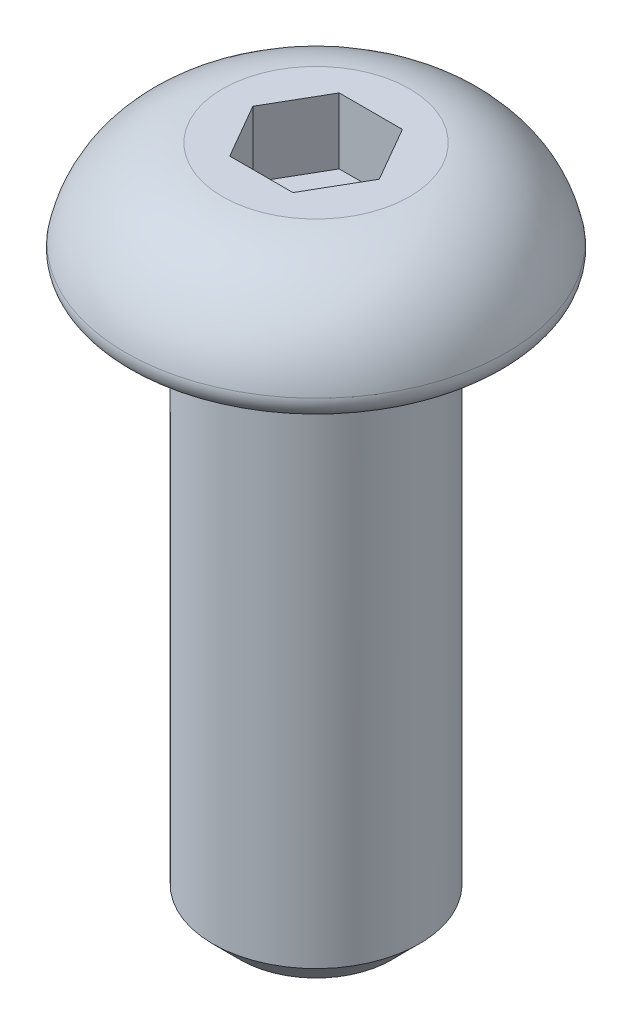
ISO-10303-21;
HEADER;
FILE_DESCRIPTION(('STEP AP214'),'2;1');
FILE_NAME('part.step','',(''),(''),'','','');
FILE_SCHEMA(('AUTOMOTIVE_DESIGN { 1 0 10303 214 1 1 1 1 }'));
ENDSEC;
DATA;
#1=APPLICATION_CONTEXT('core data for automotive mechanical design processes');
#2=APPLICATION_PROTOCOL_DEFINITION('international standard','automotive_design',2000,#1);
#3=PRODUCT_CONTEXT('',#1,'mechanical');
#4=PRODUCT('Part','Part','',(#3));
#5=PRODUCT_RELATED_PRODUCT_CATEGORY('part','',(#4));
#6=PRODUCT_DEFINITION_FORMATION('','',#4);
#7=PRODUCT_DEFINITION_CONTEXT('part definition',#1,'design');
#8=PRODUCT_DEFINITION('design','',#6,#7);
#9=PRODUCT_DEFINITION_SHAPE('','',#8);
#10=(LENGTH_UNIT() NAMED_UNIT(*) SI_UNIT(.MILLI.,.METRE.));
#11=(NAMED_UNIT(*) PLANE_ANGLE_UNIT() SI_UNIT($,.RADIAN.));
#12=(NAMED_UNIT(*) SI_UNIT($,.STERADIAN.) SOLID_ANGLE_UNIT());
#13=UNCERTAINTY_MEASURE_WITH_UNIT(LENGTH_MEASURE(1.E-05),#10,'distance_accuracy_value','');
#14=(GEOMETRIC_REPRESENTATION_CONTEXT(3) GLOBAL_UNCERTAINTY_ASSIGNED_CONTEXT((#13)) GLOBAL_UNIT_ASSIGNED_CONTEXT((#10,
#11,#12)) REPRESENTATION_CONTEXT('',''));
#15=CARTESIAN_POINT('',(0.,0.,0.));
#16=DIRECTION('',(0.,0.,1.));
#17=DIRECTION('',(1.,0.,0.));
#18=AXIS2_PLACEMENT_3D('',#15,#16,#17);
#19=CARTESIAN_POINT('',(0.,0.7366,0.));
#20=DIRECTION('',(0.,1.,0.));
#21=DIRECTION('',(-1.,0.,0.));
#22=AXIS2_PLACEMENT_3D('',#19,#20,#21);
#23=PLANE('',#22);
#24=DIRECTION('',(0.5,0.,0.866025403784439));
#25=VECTOR('',#24,1.);
#26=CARTESIAN_POINT('',(-1.07315,0.7366,0.));
#27=LINE('',#26,#25);
#28=CARTESIAN_POINT('',(-1.07315,0.7366,0.));
#29=VERTEX_POINT('',#28);
#30=CARTESIAN_POINT('',(-0.536575,0.7366,0.92937516207127));
#31=VERTEX_POINT('',#30);
#32=EDGE_CURVE('E85',#29,#31,#27,.T.);
#33=ORIENTED_EDGE('',*,*,#32,.T.);
#34=DIRECTION('',(1.,0.,0.));
#35=VECTOR('',#34,1.);
#36=CARTESIAN_POINT('',(-0.536575,0.7366,0.92937516207127));
#37=LINE('',#36,#35);
#38=CARTESIAN_POINT('',(0.536575,0.7366,0.92937516207127));
#39=VERTEX_POINT('',#38);
#40=EDGE_CURVE('E82',#31,#39,#37,.T.);
#41=ORIENTED_EDGE('',*,*,#40,.T.);
#42=DIRECTION('',(0.5,0.,-0.866025403784439));
#43=VECTOR('',#42,1.);
#44=CARTESIAN_POINT('',(0.536575,0.7366,0.92937516207127));
#45=LINE('',#44,#43);
#46=CARTESIAN_POINT('',(1.07315,0.7366,0.));
#47=VERTEX_POINT('',#46);
#48=EDGE_CURVE('E79',#39,#47,#45,.T.);
#49=ORIENTED_EDGE('',*,*,#48,.T.);
#50=DIRECTION('',(-0.5,0.,-0.866025403784439));
#51=VECTOR('',#50,1.);
#52=CARTESIAN_POINT('',(1.07315,0.7366,0.));
#53=LINE('',#52,#51);
#54=CARTESIAN_POINT('',(0.536575,0.7366,-0.92937516207127));
#55=VERTEX_POINT('',#54);
#56=EDGE_CURVE('E102',#47,#55,#53,.T.);
#57=ORIENTED_EDGE('',*,*,#56,.T.);
#58=DIRECTION('',(-1.,0.,0.));
#59=VECTOR('',#58,1.);
#60=CARTESIAN_POINT('',(0.536575,0.7366,-0.92937516207127));
#61=LINE('',#60,#59);
#62=CARTESIAN_POINT('',(-0.536575,0.7366,-0.92937516207127));
#63=VERTEX_POINT('',#62);
#64=EDGE_CURVE('E384',#55,#63,#61,.T.);
#65=ORIENTED_EDGE('',*,*,#64,.T.);
#66=DIRECTION('',(-0.5,0.,0.866025403784439));
#67=VECTOR('',#66,1.);
#68=CARTESIAN_POINT('',(-0.536575,0.7366,-0.92937516207127));
#69=LINE('',#68,#67);
#70=EDGE_CURVE('E391',#63,#29,#69,.T.);
#71=ORIENTED_EDGE('',*,*,#70,.T.);
#72=EDGE_LOOP('',(#33,#41,#49,#57,#65,#71));
#73=FACE_BOUND('',#72,.T.);
#74=ADVANCED_FACE('F15',(#73),#23,.T.);
#75=CARTESIAN_POINT('',(-0.536575,1.8542,0.92937516207127));
#76=DIRECTION('',(0.,0.,1.));
#77=DIRECTION('',(1.,0.,0.));
#78=AXIS2_PLACEMENT_3D('',#75,#76,#77);
#79=PLANE('',#78);
#80=ORIENTED_EDGE('',*,*,#40,.F.);
#81=DIRECTION('',(0.,1.,0.));
#82=VECTOR('',#81,1.);
#83=CARTESIAN_POINT('',(-0.536574999999999,1.8542,0.92937516207127));
#84=LINE('',#83,#82);
#85=CARTESIAN_POINT('',(-0.536575,1.8542,0.92937516207127));
#86=VERTEX_POINT('',#85);
#87=EDGE_CURVE('E397',#31,#86,#84,.T.);
#88=ORIENTED_EDGE('',*,*,#87,.T.);
#89=DIRECTION('',(1.,0.,0.));
#90=VECTOR('',#89,1.);
#91=CARTESIAN_POINT('',(0.,1.8542,0.92937516207127));
#92=LINE('',#91,#90);
#93=CARTESIAN_POINT('',(0.536575,1.8542,0.92937516207127));
#94=VERTEX_POINT('',#93);
#95=EDGE_CURVE('E93',#86,#94,#92,.T.);
#96=ORIENTED_EDGE('',*,*,#95,.T.);
#97=DIRECTION('',(0.,1.,0.));
#98=VECTOR('',#97,1.);
#99=CARTESIAN_POINT('',(0.536575,1.8542,0.92937516207127));
#100=LINE('',#99,#98);
#101=EDGE_CURVE('E88',#94,#39,#100,.F.);
#102=ORIENTED_EDGE('',*,*,#101,.T.);
#103=EDGE_LOOP('',(#80,#88,#96,#102));
#104=FACE_BOUND('',#103,.T.);
#105=ADVANCED_FACE('F91',(#104),#79,.F.);
#106=CARTESIAN_POINT('',(0.536575,1.8542,0.92937516207127));
#107=DIRECTION('',(0.866025403784439,0.,0.5));
#108=DIRECTION('',(0.5,0.,-0.866025403784439));
#109=AXIS2_PLACEMENT_3D('',#106,#107,#108);
#110=PLANE('',#109);
#111=ORIENTED_EDGE('',*,*,#48,.F.);
#112=ORIENTED_EDGE('',*,*,#101,.F.);
#113=DIRECTION('',(0.5,0.,-0.866025403784438));
#114=VECTOR('',#113,1.);
#115=CARTESIAN_POINT('',(0.536575,1.8542,0.92937516207127));
#116=LINE('',#115,#114);
#117=CARTESIAN_POINT('',(1.07315,1.8542,0.));
#118=VERTEX_POINT('',#117);
#119=EDGE_CURVE('E400',#94,#118,#116,.T.);
#120=ORIENTED_EDGE('',*,*,#119,.T.);
#121=DIRECTION('',(0.,1.,0.));
#122=VECTOR('',#121,1.);
#123=CARTESIAN_POINT('',(1.07315,1.8542,0.));
#124=LINE('',#123,#122);
#125=EDGE_CURVE('E99',#118,#47,#124,.F.);
#126=ORIENTED_EDGE('',*,*,#125,.T.);
#127=EDGE_LOOP('',(#111,#112,#120,#126));
#128=FACE_BOUND('',#127,.T.);
#129=ADVANCED_FACE('F97',(#128),#110,.F.);
#130=CARTESIAN_POINT('',(1.07315,1.8542,0.));
#131=DIRECTION('',(0.866025403784439,0.,-0.5));
#132=DIRECTION('',(-0.5,0.,-0.866025403784439));
#133=AXIS2_PLACEMENT_3D('',#130,#131,#132);
#134=PLANE('',#133);
#135=ORIENTED_EDGE('',*,*,#56,.F.);
#136=ORIENTED_EDGE('',*,*,#125,.F.);
#137=DIRECTION('',(-0.5,0.,-0.866025403784439));
#138=VECTOR('',#137,1.);
#139=CARTESIAN_POINT('',(1.07315,1.8542,0.));
#140=LINE('',#139,#138);
#141=CARTESIAN_POINT('',(0.536575,1.8542,-0.92937516207127));
#142=VERTEX_POINT('',#141);
#143=EDGE_CURVE('E402',#118,#142,#140,.T.);
#144=ORIENTED_EDGE('',*,*,#143,.T.);
#145=DIRECTION('',(0.,1.,0.));
#146=VECTOR('',#145,1.);
#147=CARTESIAN_POINT('',(0.536575,1.8542,-0.92937516207127));
#148=LINE('',#147,#146);
#149=EDGE_CURVE('E382',#142,#55,#148,.F.);
#150=ORIENTED_EDGE('',*,*,#149,.T.);
#151=EDGE_LOOP('',(#135,#136,#144,#150));
#152=FACE_BOUND('',#151,.T.);
#153=ADVANCED_FACE('F231',(#152),#134,.F.);
#154=CARTESIAN_POINT('',(0.536575,1.8542,-0.92937516207127));
#155=DIRECTION('',(0.,0.,-1.));
#156=DIRECTION('',(-1.,0.,0.));
#157=AXIS2_PLACEMENT_3D('',#154,#155,#156);
#158=PLANE('',#157);
#159=ORIENTED_EDGE('',*,*,#64,.F.);
#160=ORIENTED_EDGE('',*,*,#149,.F.);
#161=DIRECTION('',(1.,0.,0.));
#162=VECTOR('',#161,1.);
#163=CARTESIAN_POINT('',(0.,1.8542,-0.92937516207127));
#164=LINE('',#163,#162);
#165=CARTESIAN_POINT('',(-0.536575,1.8542,-0.92937516207127));
#166=VERTEX_POINT('',#165);
#167=EDGE_CURVE('E404',#142,#166,#164,.F.);
#168=ORIENTED_EDGE('',*,*,#167,.T.);
#169=DIRECTION('',(0.,1.,0.));
#170=VECTOR('',#169,1.);
#171=CARTESIAN_POINT('',(-0.536575,1.8542,-0.92937516207127));
#172=LINE('',#171,#170);
#173=EDGE_CURVE('E388',#166,#63,#172,.F.);
#174=ORIENTED_EDGE('',*,*,#173,.T.);
#175=EDGE_LOOP('',(#159,#160,#168,#174));
#176=FACE_BOUND('',#175,.T.);
#177=ADVANCED_FACE('F227',(#176),#158,.F.);
#178=CARTESIAN_POINT('',(-0.536575,1.8542,-0.92937516207127));
#179=DIRECTION('',(-0.866025403784439,0.,-0.5));
#180=DIRECTION('',(-0.5,0.,0.866025403784439));
#181=AXIS2_PLACEMENT_3D('',#178,#179,#180);
#182=PLANE('',#181);
#183=ORIENTED_EDGE('',*,*,#70,.F.);
#184=ORIENTED_EDGE('',*,*,#173,.F.);
#185=DIRECTION('',(-0.5,0.,0.866025403784439));
#186=VECTOR('',#185,1.);
#187=CARTESIAN_POINT('',(-0.536575,1.8542,-0.92937516207127));
#188=LINE('',#187,#186);
#189=CARTESIAN_POINT('',(-1.07315,1.8542,0.));
#190=VERTEX_POINT('',#189);
#191=EDGE_CURVE('E405',#166,#190,#188,.T.);
#192=ORIENTED_EDGE('',*,*,#191,.T.);
#193=DIRECTION('',(0.,1.,0.));
#194=VECTOR('',#193,1.);
#195=CARTESIAN_POINT('',(-1.07315,1.8542,0.));
#196=LINE('',#195,#194);
#197=EDGE_CURVE('E393',#190,#29,#196,.F.);
#198=ORIENTED_EDGE('',*,*,#197,.T.);
#199=EDGE_LOOP('',(#183,#184,#192,#198));
#200=FACE_BOUND('',#199,.T.);
#201=ADVANCED_FACE('F223',(#200),#182,.F.);
#202=CARTESIAN_POINT('',(-1.07315,1.8542,0.));
#203=DIRECTION('',(-0.866025403784439,0.,0.5));
#204=DIRECTION('',(0.5,0.,0.866025403784439));
#205=AXIS2_PLACEMENT_3D('',#202,#203,#204);
#206=PLANE('',#205);
#207=ORIENTED_EDGE('',*,*,#32,.F.);
#208=ORIENTED_EDGE('',*,*,#197,.F.);
#209=DIRECTION('',(0.5,0.,0.866025403784439));
#210=VECTOR('',#209,1.);
#211=CARTESIAN_POINT('',(-1.07315,1.8542,0.));
#212=LINE('',#211,#210);
#213=EDGE_CURVE('E113',#190,#86,#212,.T.);
#214=ORIENTED_EDGE('',*,*,#213,.T.);
#215=ORIENTED_EDGE('',*,*,#87,.F.);
#216=EDGE_LOOP('',(#207,#208,#214,#215));
#217=FACE_BOUND('',#216,.T.);
#218=ADVANCED_FACE('F219',(#217),#206,.F.);
#219=CARTESIAN_POINT('',(0.,1.8542,0.));
#220=DIRECTION('',(0.,-1.,0.));
#221=DIRECTION('',(1.,0.,0.));
#222=AXIS2_PLACEMENT_3D('',#219,#220,#221);
#223=PLANE('',#222);
#224=ORIENTED_EDGE('',*,*,#191,.F.);
#225=ORIENTED_EDGE('',*,*,#167,.F.);
#226=ORIENTED_EDGE('',*,*,#143,.F.);
#227=ORIENTED_EDGE('',*,*,#119,.F.);
#228=ORIENTED_EDGE('',*,*,#95,.F.);
#229=ORIENTED_EDGE('',*,*,#213,.F.);
#230=EDGE_LOOP('',(#224,#225,#226,#227,#228,#229));
#231=FACE_BOUND('',#230,.T.);
#232=CARTESIAN_POINT('',(0.,1.8542,0.));
#233=DIRECTION('',(0.,-1.,0.));
#234=DIRECTION('',(1.,0.,0.));
#235=AXIS2_PLACEMENT_3D('',#232,#233,#234);
#236=CIRCLE('',#235,1.5875);
#237=CARTESIAN_POINT('',(1.5875,1.8542,0.));
#238=VERTEX_POINT('',#237);
#239=EDGE_CURVE('E109',#238,#238,#236,.T.);
#240=ORIENTED_EDGE('',*,*,#239,.F.);
#241=EDGE_LOOP('',(#240));
#242=FACE_BOUND('',#241,.T.);
#243=ADVANCED_FACE('F215',(#231,#242),#223,.F.);
#244=CARTESIAN_POINT('',(-1.40765892857136,0.,0.));
#245=DIRECTION('',(0.,0.,-1.));
#246=DIRECTION('',(-1.,0.,0.));
#247=AXIS2_PLACEMENT_3D('',#244,#245,#246);
#248=CIRCLE('',#247,1.86290108459161);
#249=TRIMMED_CURVE('',#248,(PARAMETER_VALUE(-2.42740763495206)),
(PARAMETER_VALUE(2.42740763495206)),.T.,.PARAMETER.);
#250=CARTESIAN_POINT('',(0.,0.,0.));
#251=DIRECTION('',(0.,-1.,0.));
#252=AXIS1_PLACEMENT('',#250,#251);
#253=SURFACE_OF_REVOLUTION('',#249,#252);
#254=CARTESIAN_POINT('',(0.,0.381,0.));
#255=DIRECTION('',(0.,-1.,0.));
#256=DIRECTION('',(-1.,0.,0.));
#257=AXIS2_PLACEMENT_3D('',#254,#255,#256);
#258=CIRCLE('',#257,3.23118283874435);
#259=CARTESIAN_POINT('',(-3.23118283874435,0.381000000000001,0.));
#260=VERTEX_POINT('',#259);
#261=EDGE_CURVE('E112',#260,#260,#258,.T.);
#262=ORIENTED_EDGE('',*,*,#261,.F.);
#263=EDGE_LOOP('',(#262));
#264=FACE_BOUND('',#263,.T.);
#265=ORIENTED_EDGE('',*,*,#239,.T.);
#266=EDGE_LOOP('',(#265));
#267=FACE_BOUND('',#266,.T.);
#268=ADVANCED_FACE('F212',(#264,#267),#253,.F.);
#269=CARTESIAN_POINT('',(0.,0.316308645734525,0.));
#270=DIRECTION('',(0.,-1.,0.));
#271=DIRECTION('',(-1.,0.,0.));
#272=AXIS2_PLACEMENT_3D('',#269,#270,#271);
#273=TOROIDAL_SURFACE('',#272,2.92156018445415,0.316308645734525);
#274=CARTESIAN_POINT('',(0.,0.,0.));
#275=DIRECTION('',(0.,1.,0.));
#276=DIRECTION('',(1.,0.,0.));
#277=AXIS2_PLACEMENT_3D('',#274,#275,#276);
#278=CIRCLE('',#277,2.92156018445415);
#279=CARTESIAN_POINT('',(-2.92156018445415,0.,0.));
#280=VERTEX_POINT('',#279);
#281=CARTESIAN_POINT('',(2.92156018445415,0.,0.));
#282=VERTEX_POINT('',#281);
#283=EDGE_CURVE('E143',#280,#282,#278,.F.);
#284=ORIENTED_EDGE('',*,*,#283,.F.);
#285=CARTESIAN_POINT('',(0.,0.,0.));
#286=DIRECTION('',(0.,1.,0.));
#287=DIRECTION('',(-1.,0.,0.));
#288=AXIS2_PLACEMENT_3D('',#285,#286,#287);
#289=CIRCLE('',#288,2.92156018445415);
#290=EDGE_CURVE('E198',#282,#280,#289,.F.);
#291=ORIENTED_EDGE('',*,*,#290,.F.);
#292=EDGE_LOOP('',(#284,#291));
#293=FACE_BOUND('',#292,.T.);
#294=ORIENTED_EDGE('',*,*,#261,.T.);
#295=EDGE_LOOP('',(#294));
#296=FACE_BOUND('',#295,.T.);
#297=ADVANCED_FACE('F156',(#293,#296),#273,.T.);
#298=CARTESIAN_POINT('',(0.,0.,0.));
#299=DIRECTION('',(0.,-1.,0.));
#300=DIRECTION('',(1.,0.,0.));
#301=AXIS2_PLACEMENT_3D('',#298,#299,#300);
#302=PLANE('',#301);
#303=CARTESIAN_POINT('',(2.0066,0.,0.));
#304=CARTESIAN_POINT('',(2.00658906628288,-2.40006846582586E-10,0.00898483770759997));
#305=CARTESIAN_POINT('',(2.00652020155742,-7.37249562374712E-10,0.0179696218202205));
#306=CARTESIAN_POINT('',(2.0061941446447,-2.3304912611039E-09,0.0409395161030529));
#307=CARTESIAN_POINT('',(2.00585344587085,-3.60571772026111E-09,0.054923480506157));
#308=CARTESIAN_POINT('',(2.00457506155659,-6.46157344847235E-09,0.0917227668459349));
#309=CARTESIAN_POINT('',(2.00339609128486,-7.72529215155738E-09,0.114530122228028));
#310=CARTESIAN_POINT('',(2.0002705857842,-7.87204888994593E-09,0.160091427758583));
#311=CARTESIAN_POINT('',(1.99832406392506,-6.75512839147651E-09,0.182845378830336));
#312=CARTESIAN_POINT('',(1.99366395464014,-2.69131154546551E-09,0.228274536677492));
#313=CARTESIAN_POINT('',(1.99095036970954,2.55578849397591E-10,0.250949743708799));
#314=CARTESIAN_POINT('',(1.98476261223922,-4.45108584595011E-10,0.296196624859424));
#315=CARTESIAN_POINT('',(1.98128843140041,-4.09275837155462E-09,0.31876829784631));
#316=CARTESIAN_POINT('',(1.9735714623448,-1.16296188648263E-08,0.363779810164063));
#317=CARTESIAN_POINT('',(1.96932865485695,-1.55188356261111E-08,0.38621964617494));
#318=CARTESIAN_POINT('',(1.96044006084634,-8.45968624880848E-08,0.429414705043581));
#319=CARTESIAN_POINT('',(1.95584203745286,-1.45552665471966E-07,0.450179675482146));
#320=CARTESIAN_POINT('',(1.94862132024682,-1.55298023528245E-07,0.480146479302848));
#321=CARTESIAN_POINT('',(1.94630427841285,-1.47357153156127E-07,0.489422312223884));
#322=CARTESIAN_POINT('',(1.93845488958306,-1.20697712887329E-07,0.519914282434529));
#323=CARTESIAN_POINT('',(1.93263977484848,-1.013225983045E-07,0.541057632909057));
#324=CARTESIAN_POINT('',(1.91439029206296,-4.94761593905288E-08,0.603373594999736));
#325=CARTESIAN_POINT('',(1.90096630796875,-2.23185600770936E-08,0.644262998259804));
#326=CARTESIAN_POINT('',(1.88002817899466,-5.38371968375592E-09,0.701777772712149));
#327=CARTESIAN_POINT('',(1.87357054790851,-3.08129622838858E-09,0.718796782814554));
#328=CARTESIAN_POINT('',(1.85846053468184,-3.63082412684884E-10,0.757081852310378));
#329=CARTESIAN_POINT('',(1.8496755012634,-5.97277089104999E-10,0.778295942231223));
#330=CARTESIAN_POINT('',(1.83134488382159,-1.87369605321933E-09,0.820536556769746));
#331=CARTESIAN_POINT('',(1.82179525401114,-2.92051371376835E-09,0.841561325570989));
#332=CARTESIAN_POINT('',(1.80717271917223,-1.33077021916658E-08,0.872366881481264));
#333=CARTESIAN_POINT('',(1.8023707711924,-1.80238973352984E-08,0.882277029391649));
#334=CARTESIAN_POINT('',(1.79217708719647,-3.11966935064024E-08,0.902882866070016));
#335=CARTESIAN_POINT('',(1.78677055578797,-3.99450065338263E-08,0.913571240634709));
#336=CARTESIAN_POINT('',(1.77078642248604,-6.67931205081311E-08,0.944472405380037));
#337=CARTESIAN_POINT('',(1.75995521559227,-8.61935586349277E-08,0.964554727030863));
#338=CARTESIAN_POINT('',(1.73760851480512,-1.23507283181837E-07,1.00433512001833));
#339=CARTESIAN_POINT('',(1.72609300237458,-1.41420529283858E-07,1.02403318092651));
#340=CARTESIAN_POINT('',(1.7023905114411,-1.71085078097791E-07,1.06302169127755));
#341=CARTESIAN_POINT('',(1.69020352195901,-1.82836280022729E-07,1.08231213404841));
#342=CARTESIAN_POINT('',(1.66517286349559,-1.97759540908921E-07,1.12046227034095));
#343=CARTESIAN_POINT('',(1.65232919083032,-2.00931551736097E-07,1.13932196144529));
#344=CARTESIAN_POINT('',(1.62600047924252,-1.98035616872378E-07,1.17658809705647));
#345=CARTESIAN_POINT('',(1.61251544361316,-1.91967718620063E-07,1.19499454388983));
#346=CARTESIAN_POINT('',(1.58492004191759,-1.71839082360078E-07,1.2313320491883));
#347=CARTESIAN_POINT('',(1.57080968578417,-1.57778471269398E-07,1.24926311519728));
#348=CARTESIAN_POINT('',(1.54198094300483,-1.24714864157732E-07,1.28462896229569));
#349=CARTESIAN_POINT('',(1.52726257255681,-1.05711999730246E-07,1.30206375658524));
#350=CARTESIAN_POINT('',(1.4972338835073,-6.78848563461185E-08,1.33641429845855));
#351=CARTESIAN_POINT('',(1.48192358704684,-4.90605707424601E-08,1.3533300654142));
#352=CARTESIAN_POINT('',(1.45073517003508,-1.78183661723262E-08,1.38662963602009));
#353=CARTESIAN_POINT('',(1.43485707684031,-5.40013900465011E-09,1.40301346522679));
#354=CARTESIAN_POINT('',(1.41399629997253,-5.55305423018327E-10,1.42378552453106));
#355=CARTESIAN_POINT('',(1.40927514239912,-1.96074235449566E-10,1.42843819566599));
#356=CARTESIAN_POINT('',(1.39994043960853,1.06952009439073E-10,1.43757106639421));
#357=CARTESIAN_POINT('',(1.3953278811091,6.28102944414135E-11,1.44205227328457));
#358=CARTESIAN_POINT('',(1.37622793792368,-3.04222915835087E-10,1.46043744545718));
#359=CARTESIAN_POINT('',(1.36156000343603,-1.01989424615214E-09,1.47415417737718));
#360=CARTESIAN_POINT('',(1.31768369449807,-1.7141658715272E-08,1.51397317427821));
#361=CARTESIAN_POINT('',(1.28790645717692,-4.58645004976461E-08,1.53945542533707));
#362=CARTESIAN_POINT('',(1.24078596583604,-1.14932998370947E-07,1.57744305651099));
#363=CARTESIAN_POINT('',(1.22394636151741,-1.44052996188769E-07,1.59057990135876));
#364=CARTESIAN_POINT('',(1.18858672836261,-2.00452461168463E-07,1.61725579342967));
#365=CARTESIAN_POINT('',(1.17003464076639,-2.27435670539942E-07,1.63075251642277));
#366=CARTESIAN_POINT('',(1.13424468788881,-2.6141658734708E-07,1.65584645581809));
#367=CARTESIAN_POINT('',(1.11704812124,-2.70060720032428E-07,1.66750270054879));
#368=CARTESIAN_POINT('',(1.0808701491561,-2.71590085038813E-07,1.6912005021397));
#369=CARTESIAN_POINT('',(1.0618580418573,-2.63124546451694E-07,1.70319524086113));
#370=CARTESIAN_POINT('',(1.02311976678453,-2.38944811383563E-07,1.72672822730633));
#371=CARTESIAN_POINT('',(1.00338698357235,-2.23112534724474E-07,1.73825558155333));
#372=CARTESIAN_POINT('',(0.963536576085385,-1.84331265815926E-07,1.76062288804343));
#373=CARTESIAN_POINT('',(0.943418967908808,-1.61382570656229E-07,1.77146286895961));
#374=CARTESIAN_POINT('',(0.902822723639328,-1.14075086380641E-07,1.79244120990692));
#375=CARTESIAN_POINT('',(0.882344106541142,-8.97163713007642E-08,1.80257960671492));
#376=CARTESIAN_POINT('',(0.841052755267555,-4.59221550716867E-08,1.82214896820819));
#377=CARTESIAN_POINT('',(0.820240042282917,-2.64863429783458E-08,1.83157997754751));
#378=CARTESIAN_POINT('',(0.783703289804664,-5.12304302775094E-09,1.84736391611341));
#379=CARTESIAN_POINT('',(0.768051036579535,2.6922058309692E-11,1.85388345003314));
#380=CARTESIAN_POINT('',(0.750838105838987,-3.20366639247835E-11,1.86082422426493));
#381=CARTESIAN_POINT('',(0.749348260590102,-8.38164058593169E-11,1.86142310849742));
#382=CARTESIAN_POINT('',(0.734584038308932,-4.68871116541542E-10,1.86734141037689));
#383=CARTESIAN_POINT('',(0.721264099287424,2.08855791807822E-10,1.8725480377271));
#384=CARTESIAN_POINT('',(0.682508831578814,-2.91881526448029E-09,1.88721681575134));
#385=CARTESIAN_POINT('',(0.656930296735266,-1.12942442192505E-08,1.89630386939764));
#386=CARTESIAN_POINT('',(0.609684447693821,-4.41674399911067E-08,1.91202774301272));
#387=CARTESIAN_POINT('',(0.588069098194653,-6.5773082913916E-08,1.91882134236215));
#388=CARTESIAN_POINT('',(0.556534314111497,-1.05711221660184E-07,1.92814680638524));
#389=CARTESIAN_POINT('',(0.546701134503288,-1.19341588527836E-07,1.93097277770471));
#390=CARTESIAN_POINT('',(0.513624274236778,-1.65480337290844E-07,1.94020237966901));
#391=CARTESIAN_POINT('',(0.490282608629498,-1.98516429849868E-07,1.94625924154251));
#392=CARTESIAN_POINT('',(0.445896381061288,-2.50807297909331E-07,1.95691553439116));
#393=CARTESIAN_POINT('',(0.424872528360319,-2.71156597952111E-07,1.9616015207052));
#394=CARTESIAN_POINT('',(0.394772538009196,-2.84206376060979E-07,1.9677926216492));
#395=CARTESIAN_POINT('',(0.38575418477474,-2.86068750102096E-07,1.96958163504435));
#396=CARTESIAN_POINT('',(0.364783968770262,-2.867780252248E-07,1.97358960103506));
#397=CARTESIAN_POINT('',(0.352823071764271,-2.84460117319714E-07,1.97576137715437));
#398=CARTESIAN_POINT('',(0.318327971199833,-2.73769368371357E-07,1.98169866393234));
#399=CARTESIAN_POINT('',(0.295745322353831,-2.61864392602599E-07,1.98518621046868));
#400=CARTESIAN_POINT('',(0.250474497806452,-2.28491376112352E-07,1.99138064422809));
#401=CARTESIAN_POINT('',(0.227786326189335,-2.07023702516825E-07,1.99408756141409));
#402=CARTESIAN_POINT('',(0.182331068059044,-1.59542032846933E-07,1.99871554097923));
#403=CARTESIAN_POINT('',(0.159563985528845,-1.3352826305026E-07,2.00063664245572));
#404=CARTESIAN_POINT('',(0.113978889154584,-8.2610661451231E-08,2.00369975957879));
#405=CARTESIAN_POINT('',(0.0911608785091647,-5.77067618928291E-08,2.00484182284563));
#406=CARTESIAN_POINT('',(0.0410774435829059,-1.62730697381858E-08,2.00645404250534));
#407=CARTESIAN_POINT('',(0.0138062609444549,-2.29800834512604E-09,2.00675130702716));
#408=CARTESIAN_POINT('',(-0.0216327777670147,6.80570163778636E-10,2.00649360929836));
#409=CARTESIAN_POINT('',(-0.0298068283684867,3.17309944725454E-10,2.00638962054069));
#410=CARTESIAN_POINT('',(-0.0593718024018044,-8.62984956979385E-10,2.00584259676569));
#411=CARTESIAN_POINT('',(-0.0807582893729173,-1.46376846701336E-09,2.0051232214834));
#412=CARTESIAN_POINT('',(-0.138236017155039,-1.87065127810009E-08,2.00227072488124));
#413=CARTESIAN_POINT('',(-0.174298246981412,-4.61238470884554E-08,1.99950480740806));
#414=CARTESIAN_POINT('',(-0.234088382419105,-1.15814134042065E-07,1.9932891229237));
#415=CARTESIAN_POINT('',(-0.257874890124752,-1.49959987657536E-07,1.99038447051468));
#416=CARTESIAN_POINT('',(-0.304079423582726,-2.12050602396103E-07,1.98388920305184));
#417=CARTESIAN_POINT('',(-0.326503601219111,-2.40227110625724E-07,1.98034272246462));
#418=CARTESIAN_POINT('',(-0.367001325756428,-2.74404434804677E-07,1.97321869348635));
#419=CARTESIAN_POINT('',(-0.385098265733179,-2.83583966851308E-07,1.96977298891384));
#420=CARTESIAN_POINT('',(-0.427320561211157,-2.89911452696411E-07,1.96111958173694));
#421=CARTESIAN_POINT('',(-0.451405093612518,-2.81911948710855E-07,1.95571098248043));
#422=CARTESIAN_POINT('',(-0.497568838343524,-2.56274522135906E-07,1.94443796793814));
#423=CARTESIAN_POINT('',(-0.519663742532404,-2.39399261420948E-07,1.93863755337682));
#424=CARTESIAN_POINT('',(-0.563639621163233,-1.97355048413315E-07,1.92627838492324));
#425=CARTESIAN_POINT('',(-0.585520605323726,-1.72186474711733E-07,1.9197196656566));
#426=CARTESIAN_POINT('',(-0.629041401566611,-1.20138346019817E-07,1.90585060382697));
#427=CARTESIAN_POINT('',(-0.650681227470017,-9.32588896805694E-08,1.89854030458587));
#428=CARTESIAN_POINT('',(-0.693696907406694,-4.53678150243236E-08,1.88318338452097));
#429=CARTESIAN_POINT('',(-0.715072779701015,-2.4355788583544E-08,1.87513681496201));
#430=CARTESIAN_POINT('',(-0.74999540348286,-4.26168897926574E-09,1.86127971487159));
#431=CARTESIAN_POINT('',(-0.763629583248053,-4.44199106004814E-11,1.85568852008506));
#432=CARTESIAN_POINT('',(-0.77974657745273,-4.4327334349828E-11,1.84889550565212));
#433=CARTESIAN_POINT('',(-0.782283426320113,-1.91747145848651E-10,1.84782083944391));
#434=CARTESIAN_POINT('',(-0.799515826857961,-8.48635750202861E-10,1.84048529068391));
#435=CARTESIAN_POINT('',(-0.814150271403974,2.98356945732205E-10,1.83407989133117));
#436=CARTESIAN_POINT('',(-0.854302637461004,-2.01721614334083E-09,1.81592924370009));
#437=CARTESIAN_POINT('',(-0.879656796740862,-9.63566219830422E-09,1.80381864045012));
#438=CARTESIAN_POINT('',(-0.921646090892172,-3.95602163729796E-08,1.78267919316569));
#439=CARTESIAN_POINT('',(-0.938425460114042,-5.62593701875328E-08,1.77393499782701));
#440=CARTESIAN_POINT('',(-0.96644019738536,-9.12496271144871E-08,1.758826656418));
#441=CARTESIAN_POINT('',(-0.977743728259833,-1.07350494283137E-07,1.75258868185968));
#442=CARTESIAN_POINT('',(-1.00991675565169,-1.5428468204238E-07,1.73442205499891));
#443=CARTESIAN_POINT('',(-1.03063419684624,-1.85855172937867E-07,1.72222256506639));
#444=CARTESIAN_POINT('',(-1.06908325794426,-2.36072396668361E-07,1.69862897801821));
#445=CARTESIAN_POINT('',(-1.08686791024266,-2.55833039407629E-07,1.68732120362376));
#446=CARTESIAN_POINT('',(-1.11036520477006,-2.68024487182524E-07,1.67184436758946));
#447=CARTESIAN_POINT('',(-1.11624416663759,-2.69890688158664E-07,1.6679264248264));
#448=CARTESIAN_POINT('',(-1.13401078901458,-2.72978488867908E-07,1.6559480677706));
#449=CARTESIAN_POINT('',(-1.14583223014093,-2.71542937976438E-07,1.64778916424726));
#450=CARTESIAN_POINT('',(-1.17621690219919,-2.62383269728335E-07,1.62632842347281));
#451=CARTESIAN_POINT('',(-1.19464318247098,-2.51448892039462E-07,1.61283209773008));
#452=CARTESIAN_POINT('',(-1.2310185929348,-2.19522477334444E-07,1.58521290914695));
#453=CARTESIAN_POINT('',(-1.24896774160485,-1.9853083040998E-07,1.5710900706264));
#454=CARTESIAN_POINT('',(-1.2843662483949,-1.51737899077036E-07,1.54223317743014));
#455=CARTESIAN_POINT('',(-1.30181563188633,-1.25936859326695E-07,1.52749915387559));
#456=CARTESIAN_POINT('',(-1.33619952068198,-7.54966625674393E-08,1.49744407845791));
#457=CARTESIAN_POINT('',(-1.35313405831891,-5.08574325422163E-08,1.48212306359543));
#458=CARTESIAN_POINT('',(-1.38805883837396,-1.35770216564321E-08,1.44937614925313));
#459=CARTESIAN_POINT('',(-1.40599267000765,-2.32754137657912E-09,1.43189002844319));
#460=CARTESIAN_POINT('',(-1.43082238519248,8.94662698307355E-10,1.40685754408985));
#461=CARTESIAN_POINT('',(-1.43796715753326,3.36930402379066E-10,1.39955553726517));
#462=CARTESIAN_POINT('',(-1.46076718103972,-9.62201425403169E-10,1.37591209852717));
#463=CARTESIAN_POINT('',(-1.47621399259401,-1.10323565520403E-09,1.35936852710238));
#464=CARTESIAN_POINT('',(-1.51342779114361,-1.80362054002789E-08,1.31814065027419));
#465=CARTESIAN_POINT('',(-1.53487982014631,-4.23596154584822E-08,1.29317077740085));
#466=CARTESIAN_POINT('',(-1.57252441734811,-1.09372387782575E-07,1.24710605803267));
#467=CARTESIAN_POINT('',(-1.58893530690783,-1.47632442215745E-07,1.22618901398089));
#468=CARTESIAN_POINT('',(-1.6183877273678,-2.13895810587273E-07,1.18705267082538));
#469=CARTESIAN_POINT('',(-1.63155315796336,-2.42565789461285E-07,1.16892666172961));
#470=CARTESIAN_POINT('',(-1.65364821259155,-2.76138965169294E-07,1.13738926693455));
#471=CARTESIAN_POINT('',(-1.66272906214476,-2.8545555897098E-07,1.12408342111899));
#472=CARTESIAN_POINT('',(-1.6865251443928,-2.97149994382478E-07,1.08828236764449));
#473=CARTESIAN_POINT('',(-1.70094788917499,-2.90723049201479E-07,1.06559155614739));
#474=CARTESIAN_POINT('',(-1.72675784084778,-2.65514195099112E-07,1.02310626071039));
#475=CARTESIAN_POINT('',(-1.73827501972101,-2.48739440220953E-07,1.00339042713255));
#476=CARTESIAN_POINT('',(-1.760622263966,-2.06018901642363E-07,0.96357380571506));
#477=CARTESIAN_POINT('',(-1.77145236117142,-1.80073543198147E-07,0.943473035766424));
#478=CARTESIAN_POINT('',(-1.79241029600211,-1.25865906459386E-07,0.902910573464145));
#479=CARTESIAN_POINT('',(-1.80253817507397,-9.76037651221294E-08,0.882448902501313));
#480=CARTESIAN_POINT('',(-1.82208817262376,-4.7340904229741E-08,0.841192113924392));
#481=CARTESIAN_POINT('',(-1.83151034170972,-2.53397353689221E-08,0.820397020350877));
#482=CARTESIAN_POINT('',(-1.84552039098491,-5.22283902953767E-09,0.787948901948377));
#483=CARTESIAN_POINT('',(-1.85036991118091,-8.07482547039752E-10,0.776408175513655));
#484=CARTESIAN_POINT('',(-1.85636928077019,1.06930468963506E-10,0.761813353437745));
#485=CARTESIAN_POINT('',(-1.8576033873762,4.53639279635016E-11,0.758793668022586));
#486=CARTESIAN_POINT('',(-1.86510046041134,-2.32652427908758E-10,0.740333897485414));
#487=CARTESIAN_POINT('',(-1.87119727949627,-4.65008069075365E-11,0.724825970606976));
#488=CARTESIAN_POINT('',(-1.88760764103558,-2.37579281652051E-09,0.681500420778963));
#489=CARTESIAN_POINT('',(-1.89749879632736,-7.11293670964704E-09,0.653521031019783));
#490=CARTESIAN_POINT('',(-1.91176115789378,-2.22627965598493E-08,0.610161516609964));
#491=CARTESIAN_POINT('',(-1.91657355213373,-2.90483442262346E-08,0.59492458137037));
#492=CARTESIAN_POINT('',(-1.92550176906631,-4.41123852035323E-08,0.565429285017523));
#493=CARTESIAN_POINT('',(-1.92964279219373,-5.22500286234025E-08,0.551178566423921));
#494=CARTESIAN_POINT('',(-1.93991872691168,-7.19484887485474E-08,0.514276332106787));
#495=CARTESIAN_POINT('',(-1.9458131988365,-8.27489896918848E-08,0.491557454121607));
#496=CARTESIAN_POINT('',(-1.95627921880208,-9.58169365676793E-08,0.448055620938705));
#497=CARTESIAN_POINT('',(-1.96092290529388,-9.87870963948514E-08,0.427290020700065));
#498=CARTESIAN_POINT('',(-1.96633203112534,-9.5412769600497E-08,0.401117430591457));
#499=CARTESIAN_POINT('',(-1.96741312169168,-9.43531861907095E-08,0.395774640544488));
#500=CARTESIAN_POINT('',(-1.97169811613411,-8.95834608104608E-08,0.374141774930771));
#501=CARTESIAN_POINT('',(-1.97472051599352,-8.48852361829975E-08,0.357815342330161));
#502=CARTESIAN_POINT('',(-1.98142344766441,-7.35203556233253E-08,0.318911143523918));
#503=CARTESIAN_POINT('',(-1.98492127578626,-6.67805688640963E-08,0.29630175526358));
#504=CARTESIAN_POINT('',(-1.99113944544208,-5.28632491387511E-08,0.250976895677919));
#505=CARTESIAN_POINT('',(-1.99385980134583,-4.56857242661923E-08,0.228261426321149));
#506=CARTESIAN_POINT('',(-1.99852015754898,-3.19796931964664E-08,0.182751036842652));
#507=CARTESIAN_POINT('',(-2.00046017478117,-2.54511729186744E-08,0.159956118455741));
#508=CARTESIAN_POINT('',(-2.00355747362569,-1.40036853475103E-08,0.114313746395605));
#509=CARTESIAN_POINT('',(-2.00471477474039,-9.08467795264582E-09,0.0914662940455648));
#510=CARTESIAN_POINT('',(-2.00624552798196,-2.09576520658758E-09,0.0457457910434903));
#511=CARTESIAN_POINT('',(-2.00661900216082,-2.57797022917396E-11,0.0228727411297263));
#512=CARTESIAN_POINT('',(-2.0066,0.,0.));
#513=B_SPLINE_CURVE_WITH_KNOTS('',3,(#303,#304,#305,#306,#307,#308,#309,#310,#311,#312,#313,
#314,#315,#316,#317,#318,#319,#320,#321,#322,#323,#324,#325,#326,#327,#328,#329,#330,#331,#332,
#333,#334,#335,#336,#337,#338,#339,#340,#341,#342,#343,#344,#345,#346,#347,#348,#349,#350,#351,
#352,#353,#354,#355,#356,#357,#358,#359,#360,#361,#362,#363,#364,#365,#366,#367,#368,#369,#370,
#371,#372,#373,#374,#375,#376,#377,#378,#379,#380,#381,#382,#383,#384,#385,#386,#387,#388,#389,
#390,#391,#392,#393,#394,#395,#396,#397,#398,#399,#400,#401,#402,#403,#404,#405,#406,#407,#408,
#409,#410,#411,#412,#413,#414,#415,#416,#417,#418,#419,#420,#421,#422,#423,#424,#425,#426,#427,
#428,#429,#430,#431,#432,#433,#434,#435,#436,#437,#438,#439,#440,#441,#442,#443,#444,#445,#446,
#447,#448,#449,#450,#451,#452,#453,#454,#455,#456,#457,#458,#459,#460,#461,#462,#463,#464,#465,
#466,#467,#468,#469,#470,#471,#472,#473,#474,#475,#476,#477,#478,#479,#480,#481,#482,#483,#484,
#485,#486,#487,#488,#489,#490,#491,#492,#493,#494,#495,#496,#497,#498,#499,#500,#501,#502,#503,
#504,#505,#506,#507,#508,#509,#510,#511,#512),.UNSPECIFIED.,.F.,.F.,(4,2,2,2,2,2,2,2,2,2,2,2,2,
2,2,2,2,2,2,2,2,2,2,2,2,2,2,2,2,2,2,2,2,2,2,2,2,2,2,2,2,2,2,2,2,2,2,2,2,2,2,2,2,2,2,2,2,2,2,2,2,
2,2,2,2,2,2,2,2,2,2,2,2,2,2,2,2,2,2,2,2,2,2,2,2,2,2,2,2,2,2,2,2,2,2,2,2,2,2,2,2,2,2,2,4),(0.,
0.026954398400272,0.0689159743575669,0.137415536517293,0.205913905554104,0.274412051774882,
0.34291094543617,0.411411556743022,0.475202443662755,0.50388391291198,0.569659586654283,
0.698661637909456,0.753266445811729,0.82213602000068,0.89139774141223,0.92443327798541,
0.960365487133333,1.02880177344663,1.09723991447675,1.16567917485264,1.23411881921039,
1.30255811219362,1.37099631845367,1.43943270264985,1.50786652944979,1.57629706352999,
1.59618235755883,1.61547495664453,1.6757144352406,1.79321188240404,1.8572762143631,
1.92608752697236,1.9884018919571,2.05582755105098,2.12437330078241,2.19291618931341,
2.26145548211698,2.32999044470949,2.38085204350461,2.38566917780034,2.42857074496565,
2.50998033117764,2.57794045248246,2.60863328486177,2.68095956116592,2.74556679384386,
2.77314831364982,2.80961584841838,2.87815233468266,2.9466861899577,3.01521663499516,
3.0837428905965,3.16553614128483,3.19006016530962,3.25424606525981,3.36269067644835,
3.43456669697418,3.50266085327889,3.55792059995264,3.63195525425324,3.70047295663869,
3.76898753161305,3.83749815954587,3.90600402086267,3.95020882006364,3.95847409278078,
4.00639496545848,4.0906611011313,4.14741738998601,4.18614698262536,4.25825717747943,
4.32147094520796,4.34266530837131,4.38575285999928,4.45425945431422,4.52276339167639,
4.59126384513222,4.65975998778329,4.73488416286361,4.76553177529547,4.83342101389725,
4.93213621850365,5.01187535259757,5.07906969743342,5.12739347329367,5.20802846336904,
5.27651569898348,5.34499975914688,5.41347977377078,5.48195487282865,5.51950766831233,
5.52929407016124,5.57927982232654,5.66827453054927,5.71620735528828,5.76072437670224,
5.83112222311661,5.89494550087415,5.91129864393688,5.96110469898164,6.02972595651202,
6.09834594565431,6.16696444571116,6.23558123598746,6.30419609579033),.UNSPECIFIED.);
#514=CARTESIAN_POINT('',(-2.00659999999995,0.,-1.79212456634879E-12));
#515=VERTEX_POINT('',#514);
#516=CARTESIAN_POINT('',(2.00659999999995,0.,3.76449563253653E-12));
#517=VERTEX_POINT('',#516);
#518=EDGE_CURVE('E116',#515,#517,#513,.F.);
#519=ORIENTED_EDGE('',*,*,#518,.T.);
#520=CARTESIAN_POINT('',(0.,0.,0.));
#521=DIRECTION('',(0.,-1.,0.));
#522=DIRECTION('',(-1.,0.,-2.30804785306791E-12));
#523=AXIS2_PLACEMENT_3D('',#520,#521,#522);
#524=CIRCLE('',#523,2.00659999999993);
#525=EDGE_CURVE('E34',#517,#515,#524,.F.);
#526=ORIENTED_EDGE('',*,*,#525,.T.);
#527=EDGE_LOOP('',(#519,#526));
#528=FACE_BOUND('',#527,.T.);
#529=ORIENTED_EDGE('',*,*,#283,.T.);
#530=ORIENTED_EDGE('',*,*,#290,.T.);
#531=EDGE_LOOP('',(#529,#530));
#532=FACE_BOUND('',#531,.T.);
#533=ADVANCED_FACE('F148',(#528,#532),#302,.T.);
#534=CARTESIAN_POINT('',(0.,-9.525,0.));
#535=DIRECTION('',(0.,1.,0.));
#536=DIRECTION('',(0.,0.,1.));
#537=AXIS2_PLACEMENT_3D('',#534,#535,#536);
#538=PLANE('',#537);
#539=CARTESIAN_POINT('',(0.,-9.52500000002909,0.));
#540=DIRECTION('',(0.,1.,0.));
#541=DIRECTION('',(0.,0.,1.));
#542=AXIS2_PLACEMENT_3D('',#539,#540,#541);
#543=CIRCLE('',#542,1.28015999997089);
#544=CARTESIAN_POINT('',(0.,-9.52500000002909,1.28015999997089));
#545=VERTEX_POINT('',#544);
#546=EDGE_CURVE('E106',#545,#545,#543,.T.);
#547=ORIENTED_EDGE('',*,*,#546,.F.);
#548=EDGE_LOOP('',(#547));
#549=FACE_BOUND('',#548,.T.);
#550=ADVANCED_FACE('F132',(#549),#538,.F.);
#551=CARTESIAN_POINT('',(0.,-0.254,0.));
#552=DIRECTION('',(0.,1.,0.));
#553=DIRECTION('',(0.999909777895839,0.,0.0134326493401069));
#554=AXIS2_PLACEMENT_3D('',#551,#552,#553);
#555=TOROIDAL_SURFACE('',#554,2.0066,0.254);
#556=ORIENTED_EDGE('',*,*,#525,.F.);
#557=ORIENTED_EDGE('',*,*,#518,.F.);
#558=EDGE_LOOP('',(#556,#557));
#559=FACE_BOUND('',#558,.T.);
#560=CARTESIAN_POINT('',(0.,-0.254,0.));
#561=DIRECTION('',(0.,1.,0.));
#562=DIRECTION('',(0.,0.,1.));
#563=AXIS2_PLACEMENT_3D('',#560,#561,#562);
#564=CIRCLE('',#563,1.7526);
#565=CARTESIAN_POINT('',(0.,-0.254,1.7526));
#566=VERTEX_POINT('',#565);
#567=EDGE_CURVE('E26',#566,#566,#564,.F.);
#568=ORIENTED_EDGE('',*,*,#567,.F.);
#569=EDGE_LOOP('',(#568));
#570=FACE_BOUND('',#569,.T.);
#571=ADVANCED_FACE('F120',(#559,#570),#555,.F.);
#572=CARTESIAN_POINT('',(0.,-9.05256000007093,0.));
#573=DIRECTION('',(0.,1.,0.));
#574=DIRECTION('',(0.,0.,1.));
#575=AXIS2_PLACEMENT_3D('',#572,#573,#574);
#576=CONICAL_SURFACE('',#575,1.75259999992916,0.785398163397566);
#577=CARTESIAN_POINT('',(0.,-9.05256,0.));
#578=DIRECTION('',(0.,1.,0.));
#579=DIRECTION('',(0.,0.,1.));
#580=AXIS2_PLACEMENT_3D('',#577,#578,#579);
#581=CIRCLE('',#580,1.7526);
#582=CARTESIAN_POINT('',(0.,-9.05256,1.7526));
#583=VERTEX_POINT('',#582);
#584=EDGE_CURVE('E10',#583,#583,#581,.T.);
#585=ORIENTED_EDGE('',*,*,#584,.F.);
#586=EDGE_LOOP('',(#585));
#587=FACE_BOUND('',#586,.T.);
#588=ORIENTED_EDGE('',*,*,#546,.T.);
#589=EDGE_LOOP('',(#588));
#590=FACE_BOUND('',#589,.T.);
#591=ADVANCED_FACE('F131',(#587,#590),#576,.T.);
#592=CARTESIAN_POINT('',(0.,0.,0.));
#593=DIRECTION('',(0.,1.,0.));
#594=DIRECTION('',(0.,0.,1.));
#595=AXIS2_PLACEMENT_3D('',#592,#593,#594);
#596=CYLINDRICAL_SURFACE('',#595,1.7526);
#597=ORIENTED_EDGE('',*,*,#567,.T.);
#598=EDGE_LOOP('',(#597));
#599=FACE_BOUND('',#598,.T.);
#600=ORIENTED_EDGE('',*,*,#584,.T.);
#601=EDGE_LOOP('',(#600));
#602=FACE_BOUND('',#601,.T.);
#603=ADVANCED_FACE('F242',(#599,#602),#596,.T.);
#604=CLOSED_SHELL('',(#74,#105,#129,#153,#177,#201,#218,#243,#268,#297,#533,#550,#571,#591,#603));
#605=MANIFOLD_SOLID_BREP('B1',#604);
#606=ADVANCED_BREP_SHAPE_REPRESENTATION('',(#18,#605),#14);
#607=SHAPE_DEFINITION_REPRESENTATION(#9,#606);
ENDSEC;
END-ISO-10303-21;
